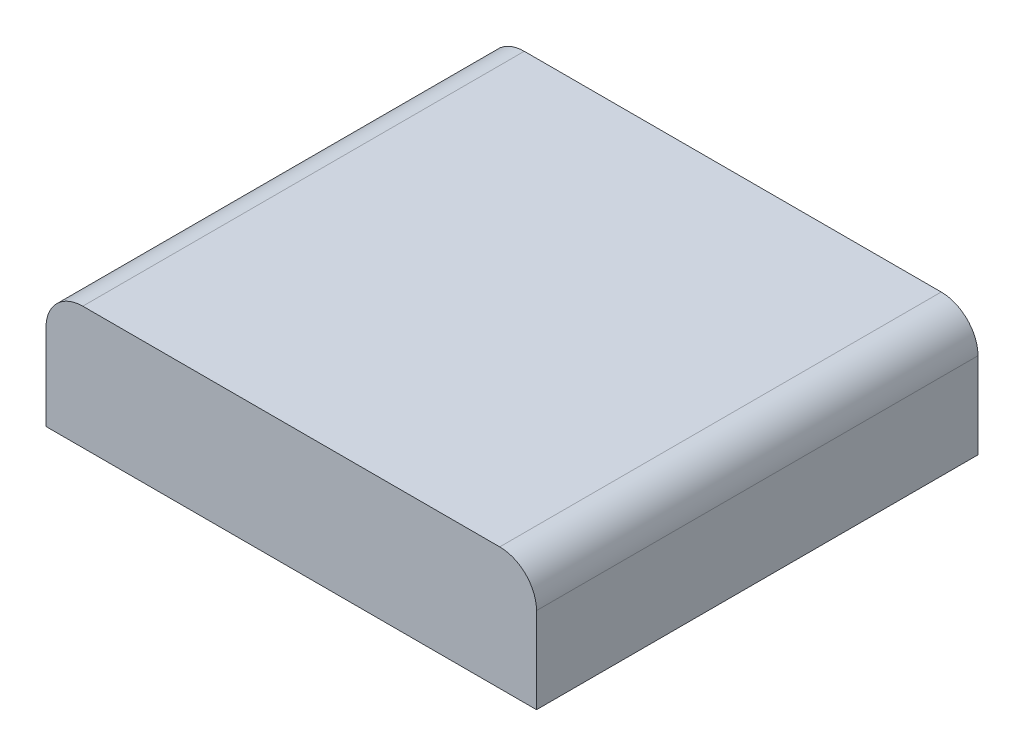
ISO-10303-21;
HEADER;
FILE_DESCRIPTION(('STEP AP214'),'2;1');
FILE_NAME('part.step','',(''),(''),'','','');
FILE_SCHEMA(('AUTOMOTIVE_DESIGN { 1 0 10303 214 1 1 1 1 }'));
ENDSEC;
DATA;
#1=APPLICATION_CONTEXT('core data for automotive mechanical design processes');
#2=APPLICATION_PROTOCOL_DEFINITION('international standard','automotive_design',2000,#1);
#3=PRODUCT_CONTEXT('',#1,'mechanical');
#4=PRODUCT('Part','Part','',(#3));
#5=PRODUCT_RELATED_PRODUCT_CATEGORY('part','',(#4));
#6=PRODUCT_DEFINITION_FORMATION('','',#4);
#7=PRODUCT_DEFINITION_CONTEXT('part definition',#1,'design');
#8=PRODUCT_DEFINITION('design','',#6,#7);
#9=PRODUCT_DEFINITION_SHAPE('','',#8);
#10=(LENGTH_UNIT() NAMED_UNIT(*) SI_UNIT(.MILLI.,.METRE.));
#11=(NAMED_UNIT(*) PLANE_ANGLE_UNIT() SI_UNIT($,.RADIAN.));
#12=(NAMED_UNIT(*) SI_UNIT($,.STERADIAN.) SOLID_ANGLE_UNIT());
#13=UNCERTAINTY_MEASURE_WITH_UNIT(LENGTH_MEASURE(1.E-05),#10,'distance_accuracy_value','');
#14=(GEOMETRIC_REPRESENTATION_CONTEXT(3) GLOBAL_UNCERTAINTY_ASSIGNED_CONTEXT((#13)) GLOBAL_UNIT_ASSIGNED_CONTEXT((#10,
#11,#12)) REPRESENTATION_CONTEXT('',''));
#15=CARTESIAN_POINT('',(0.,0.,0.));
#16=DIRECTION('',(0.,0.,1.));
#17=DIRECTION('',(1.,0.,0.));
#18=AXIS2_PLACEMENT_3D('',#15,#16,#17);
#19=CARTESIAN_POINT('',(0.,0.,57.15));
#20=DIRECTION('',(1.,0.,0.));
#21=DIRECTION('',(0.,0.,-1.));
#22=AXIS2_PLACEMENT_3D('',#19,#20,#21);
#23=PLANE('',#22);
#24=DIRECTION('',(0.,-1.,0.));
#25=VECTOR('',#24,1.);
#26=CARTESIAN_POINT('',(0.,0.,0.));
#27=LINE('',#26,#25);
#28=CARTESIAN_POINT('',(0.,11.1125,0.));
#29=VERTEX_POINT('',#28);
#30=CARTESIAN_POINT('',(0.,0.,0.));
#31=VERTEX_POINT('',#30);
#32=EDGE_CURVE('E121',#29,#31,#27,.T.);
#33=ORIENTED_EDGE('',*,*,#32,.T.);
#34=DIRECTION('',(0.,0.,-1.));
#35=VECTOR('',#34,1.);
#36=CARTESIAN_POINT('',(0.,0.,57.15));
#37=LINE('',#36,#35);
#38=CARTESIAN_POINT('',(0.,0.,57.15));
#39=VERTEX_POINT('',#38);
#40=EDGE_CURVE('E11',#39,#31,#37,.T.);
#41=ORIENTED_EDGE('',*,*,#40,.F.);
#42=DIRECTION('',(0.,-1.,0.));
#43=VECTOR('',#42,1.);
#44=CARTESIAN_POINT('',(0.,0.,57.15));
#45=LINE('',#44,#43);
#46=CARTESIAN_POINT('',(0.,11.1125,57.15));
#47=VERTEX_POINT('',#46);
#48=EDGE_CURVE('E131',#47,#39,#45,.T.);
#49=ORIENTED_EDGE('',*,*,#48,.F.);
#50=DIRECTION('',(0.,0.,-1.));
#51=VECTOR('',#50,1.);
#52=CARTESIAN_POINT('',(0.,11.1125,57.15));
#53=LINE('',#52,#51);
#54=EDGE_CURVE('E117',#47,#29,#53,.T.);
#55=ORIENTED_EDGE('',*,*,#54,.T.);
#56=EDGE_LOOP('',(#33,#41,#49,#55));
#57=FACE_BOUND('',#56,.T.);
#58=ADVANCED_FACE('F37',(#57),#23,.F.);
#59=CARTESIAN_POINT('',(0.,0.,57.15));
#60=DIRECTION('',(0.,1.,0.));
#61=DIRECTION('',(0.,0.,1.));
#62=AXIS2_PLACEMENT_3D('',#59,#60,#61);
#63=PLANE('',#62);
#64=DIRECTION('',(1.,0.,0.));
#65=VECTOR('',#64,1.);
#66=CARTESIAN_POINT('',(0.,0.,0.));
#67=LINE('',#66,#65);
#68=CARTESIAN_POINT('',(63.5,0.,0.));
#69=VERTEX_POINT('',#68);
#70=EDGE_CURVE('E124',#31,#69,#67,.T.);
#71=ORIENTED_EDGE('',*,*,#70,.T.);
#72=DIRECTION('',(0.,0.,-1.));
#73=VECTOR('',#72,1.);
#74=CARTESIAN_POINT('',(63.5,0.,57.15));
#75=LINE('',#74,#73);
#76=CARTESIAN_POINT('',(63.5,0.,57.15));
#77=VERTEX_POINT('',#76);
#78=EDGE_CURVE('E45',#77,#69,#75,.T.);
#79=ORIENTED_EDGE('',*,*,#78,.F.);
#80=DIRECTION('',(1.,0.,0.));
#81=VECTOR('',#80,1.);
#82=CARTESIAN_POINT('',(0.,0.,57.15));
#83=LINE('',#82,#81);
#84=EDGE_CURVE('E90',#39,#77,#83,.T.);
#85=ORIENTED_EDGE('',*,*,#84,.F.);
#86=ORIENTED_EDGE('',*,*,#40,.T.);
#87=EDGE_LOOP('',(#71,#79,#85,#86));
#88=FACE_BOUND('',#87,.T.);
#89=ADVANCED_FACE('F155',(#88),#63,.F.);
#90=CARTESIAN_POINT('',(63.5,0.,57.15));
#91=DIRECTION('',(-1.,0.,0.));
#92=DIRECTION('',(0.,0.,1.));
#93=AXIS2_PLACEMENT_3D('',#90,#91,#92);
#94=PLANE('',#93);
#95=DIRECTION('',(0.,1.,0.));
#96=VECTOR('',#95,1.);
#97=CARTESIAN_POINT('',(63.5,0.,0.));
#98=LINE('',#97,#96);
#99=CARTESIAN_POINT('',(63.5,11.1125,0.));
#100=VERTEX_POINT('',#99);
#101=EDGE_CURVE('E126',#69,#100,#98,.T.);
#102=ORIENTED_EDGE('',*,*,#101,.T.);
#103=DIRECTION('',(0.,0.,-1.));
#104=VECTOR('',#103,1.);
#105=CARTESIAN_POINT('',(63.5,11.1125,57.15));
#106=LINE('',#105,#104);
#107=CARTESIAN_POINT('',(63.5,11.1125,57.15));
#108=VERTEX_POINT('',#107);
#109=EDGE_CURVE('E112',#108,#100,#106,.T.);
#110=ORIENTED_EDGE('',*,*,#109,.F.);
#111=DIRECTION('',(0.,1.,0.));
#112=VECTOR('',#111,1.);
#113=CARTESIAN_POINT('',(63.5,0.,57.15));
#114=LINE('',#113,#112);
#115=EDGE_CURVE('E103',#77,#108,#114,.T.);
#116=ORIENTED_EDGE('',*,*,#115,.F.);
#117=ORIENTED_EDGE('',*,*,#78,.T.);
#118=EDGE_LOOP('',(#102,#110,#116,#117));
#119=FACE_BOUND('',#118,.T.);
#120=ADVANCED_FACE('F137',(#119),#94,.F.);
#121=CARTESIAN_POINT('',(58.7375,11.1125,57.15));
#122=DIRECTION('',(0.,0.,-1.));
#123=DIRECTION('',(-1.,0.,0.));
#124=AXIS2_PLACEMENT_3D('',#121,#122,#123);
#125=CYLINDRICAL_SURFACE('',#124,4.7625);
#126=CARTESIAN_POINT('',(58.7375,11.1125,0.));
#127=DIRECTION('',(0.,0.,1.));
#128=DIRECTION('',(1.,0.,0.));
#129=AXIS2_PLACEMENT_3D('',#126,#127,#128);
#130=CIRCLE('',#129,4.7625);
#131=CARTESIAN_POINT('',(58.7375,15.875,0.));
#132=VERTEX_POINT('',#131);
#133=EDGE_CURVE('E111',#100,#132,#130,.T.);
#134=ORIENTED_EDGE('',*,*,#133,.T.);
#135=DIRECTION('',(0.,0.,-1.));
#136=VECTOR('',#135,1.);
#137=CARTESIAN_POINT('',(58.7375,15.875,57.15));
#138=LINE('',#137,#136);
#139=CARTESIAN_POINT('',(58.7375,15.875,57.15));
#140=VERTEX_POINT('',#139);
#141=EDGE_CURVE('E108',#140,#132,#138,.T.);
#142=ORIENTED_EDGE('',*,*,#141,.F.);
#143=CARTESIAN_POINT('',(58.7375,11.1125,57.15));
#144=DIRECTION('',(0.,0.,1.));
#145=DIRECTION('',(1.,0.,0.));
#146=AXIS2_PLACEMENT_3D('',#143,#144,#145);
#147=CIRCLE('',#146,4.7625);
#148=EDGE_CURVE('E97',#108,#140,#147,.T.);
#149=ORIENTED_EDGE('',*,*,#148,.F.);
#150=ORIENTED_EDGE('',*,*,#109,.T.);
#151=EDGE_LOOP('',(#134,#142,#149,#150));
#152=FACE_BOUND('',#151,.T.);
#153=ADVANCED_FACE('F109',(#152),#125,.T.);
#154=CARTESIAN_POINT('',(4.76250000000003,15.875,57.15));
#155=DIRECTION('',(0.,-1.,0.));
#156=DIRECTION('',(0.,0.,-1.));
#157=AXIS2_PLACEMENT_3D('',#154,#155,#156);
#158=PLANE('',#157);
#159=DIRECTION('',(-1.,0.,0.));
#160=VECTOR('',#159,1.);
#161=CARTESIAN_POINT('',(4.76250000000003,15.875,0.));
#162=LINE('',#161,#160);
#163=CARTESIAN_POINT('',(4.76250000000003,15.875,0.));
#164=VERTEX_POINT('',#163);
#165=EDGE_CURVE('E76',#132,#164,#162,.T.);
#166=ORIENTED_EDGE('',*,*,#165,.T.);
#167=DIRECTION('',(0.,0.,-1.));
#168=VECTOR('',#167,1.);
#169=CARTESIAN_POINT('',(4.76250000000003,15.875,57.15));
#170=LINE('',#169,#168);
#171=CARTESIAN_POINT('',(4.76250000000003,15.875,57.15));
#172=VERTEX_POINT('',#171);
#173=EDGE_CURVE('E113',#172,#164,#170,.T.);
#174=ORIENTED_EDGE('',*,*,#173,.F.);
#175=DIRECTION('',(-1.,0.,0.));
#176=VECTOR('',#175,1.);
#177=CARTESIAN_POINT('',(4.76250000000003,15.875,57.15));
#178=LINE('',#177,#176);
#179=EDGE_CURVE('E101',#140,#172,#178,.T.);
#180=ORIENTED_EDGE('',*,*,#179,.F.);
#181=ORIENTED_EDGE('',*,*,#141,.T.);
#182=EDGE_LOOP('',(#166,#174,#180,#181));
#183=FACE_BOUND('',#182,.T.);
#184=ADVANCED_FACE('F115',(#183),#158,.F.);
#185=CARTESIAN_POINT('',(4.7625,11.1125,57.15));
#186=DIRECTION('',(0.,0.,-1.));
#187=DIRECTION('',(-1.,0.,0.));
#188=AXIS2_PLACEMENT_3D('',#185,#186,#187);
#189=CYLINDRICAL_SURFACE('',#188,4.7625);
#190=CARTESIAN_POINT('',(4.7625,11.1125,0.));
#191=DIRECTION('',(0.,0.,1.));
#192=DIRECTION('',(-1.,0.,0.));
#193=AXIS2_PLACEMENT_3D('',#190,#191,#192);
#194=CIRCLE('',#193,4.7625);
#195=EDGE_CURVE('E82',#164,#29,#194,.T.);
#196=ORIENTED_EDGE('',*,*,#195,.T.);
#197=ORIENTED_EDGE('',*,*,#54,.F.);
#198=CARTESIAN_POINT('',(4.7625,11.1125,57.15));
#199=DIRECTION('',(0.,0.,1.));
#200=DIRECTION('',(-1.,0.,0.));
#201=AXIS2_PLACEMENT_3D('',#198,#199,#200);
#202=CIRCLE('',#201,4.7625);
#203=EDGE_CURVE('E53',#172,#47,#202,.T.);
#204=ORIENTED_EDGE('',*,*,#203,.F.);
#205=ORIENTED_EDGE('',*,*,#173,.T.);
#206=EDGE_LOOP('',(#196,#197,#204,#205));
#207=FACE_BOUND('',#206,.T.);
#208=ADVANCED_FACE('F144',(#207),#189,.T.);
#209=CARTESIAN_POINT('',(4.7625,11.1125,57.15));
#210=DIRECTION('',(0.,0.,-1.));
#211=DIRECTION('',(-1.,0.,0.));
#212=AXIS2_PLACEMENT_3D('',#209,#210,#211);
#213=PLANE('',#212);
#214=ORIENTED_EDGE('',*,*,#48,.T.);
#215=ORIENTED_EDGE('',*,*,#84,.T.);
#216=ORIENTED_EDGE('',*,*,#115,.T.);
#217=ORIENTED_EDGE('',*,*,#148,.T.);
#218=ORIENTED_EDGE('',*,*,#179,.T.);
#219=ORIENTED_EDGE('',*,*,#203,.T.);
#220=EDGE_LOOP('',(#214,#215,#216,#217,#218,#219));
#221=FACE_BOUND('',#220,.T.);
#222=ADVANCED_FACE('F99',(#221),#213,.F.);
#223=CARTESIAN_POINT('',(4.7625,11.1125,0.));
#224=DIRECTION('',(0.,0.,-1.));
#225=DIRECTION('',(-1.,0.,0.));
#226=AXIS2_PLACEMENT_3D('',#223,#224,#225);
#227=PLANE('',#226);
#228=ORIENTED_EDGE('',*,*,#32,.F.);
#229=ORIENTED_EDGE('',*,*,#195,.F.);
#230=ORIENTED_EDGE('',*,*,#165,.F.);
#231=ORIENTED_EDGE('',*,*,#133,.F.);
#232=ORIENTED_EDGE('',*,*,#101,.F.);
#233=ORIENTED_EDGE('',*,*,#70,.F.);
#234=EDGE_LOOP('',(#228,#229,#230,#231,#232,#233));
#235=FACE_BOUND('',#234,.T.);
#236=ADVANCED_FACE('F140',(#235),#227,.T.);
#237=CLOSED_SHELL('',(#58,#89,#120,#153,#184,#208,#222,#236));
#238=MANIFOLD_SOLID_BREP('B2',#237);
#239=ADVANCED_BREP_SHAPE_REPRESENTATION('',(#18,#238),#14);
#240=SHAPE_DEFINITION_REPRESENTATION(#9,#239);
ENDSEC;
END-ISO-10303-21;
